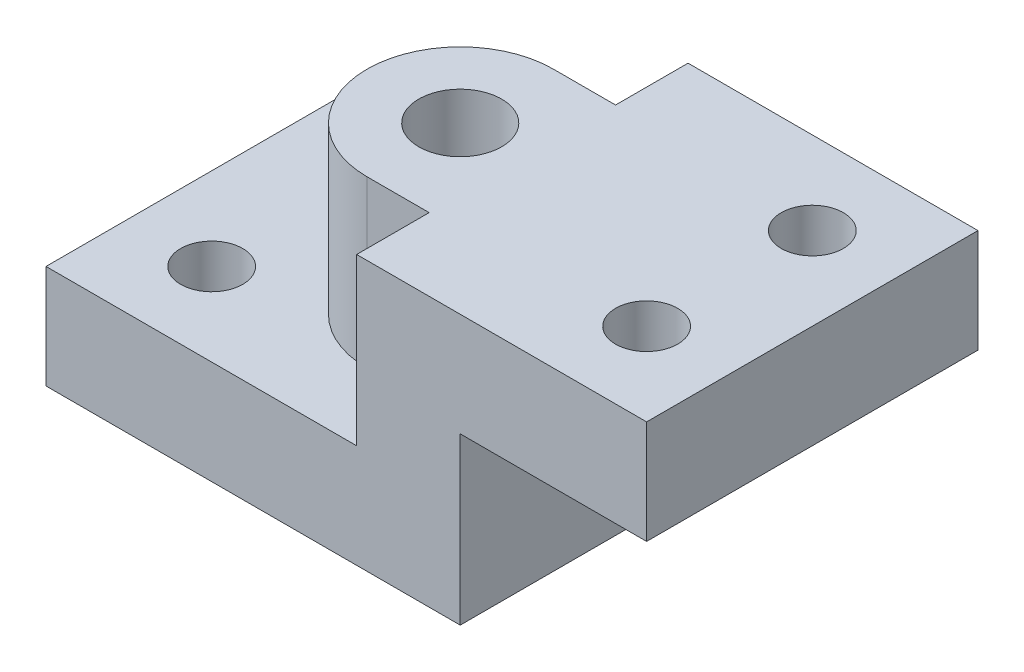
ISO-10303-21;
HEADER;
FILE_DESCRIPTION(('STEP AP214'),'2;1');
FILE_NAME('part.step','',(''),(''),'','','');
FILE_SCHEMA(('AUTOMOTIVE_DESIGN { 1 0 10303 214 1 1 1 1 }'));
ENDSEC;
DATA;
#1=APPLICATION_CONTEXT('core data for automotive mechanical design processes');
#2=APPLICATION_PROTOCOL_DEFINITION('international standard','automotive_design',2000,#1);
#3=PRODUCT_CONTEXT('',#1,'mechanical');
#4=PRODUCT('Part','Part','',(#3));
#5=PRODUCT_RELATED_PRODUCT_CATEGORY('part','',(#4));
#6=PRODUCT_DEFINITION_FORMATION('','',#4);
#7=PRODUCT_DEFINITION_CONTEXT('part definition',#1,'design');
#8=PRODUCT_DEFINITION('design','',#6,#7);
#9=PRODUCT_DEFINITION_SHAPE('','',#8);
#10=(LENGTH_UNIT() NAMED_UNIT(*) SI_UNIT(.MILLI.,.METRE.));
#11=(NAMED_UNIT(*) PLANE_ANGLE_UNIT() SI_UNIT($,.RADIAN.));
#12=(NAMED_UNIT(*) SI_UNIT($,.STERADIAN.) SOLID_ANGLE_UNIT());
#13=UNCERTAINTY_MEASURE_WITH_UNIT(LENGTH_MEASURE(1.E-05),#10,'distance_accuracy_value','');
#14=(GEOMETRIC_REPRESENTATION_CONTEXT(3) GLOBAL_UNCERTAINTY_ASSIGNED_CONTEXT((#13)) GLOBAL_UNIT_ASSIGNED_CONTEXT((#10,
#11,#12)) REPRESENTATION_CONTEXT('',''));
#15=CARTESIAN_POINT('',(0.,0.,0.));
#16=DIRECTION('',(0.,0.,1.));
#17=DIRECTION('',(1.,0.,0.));
#18=AXIS2_PLACEMENT_3D('',#15,#16,#17);
#19=CARTESIAN_POINT('',(39.649493318189,0.,80.));
#20=DIRECTION('',(-1.,0.,0.));
#21=DIRECTION('',(0.,0.,1.));
#22=AXIS2_PLACEMENT_3D('',#19,#20,#21);
#23=PLANE('',#22);
#24=DIRECTION('',(0.,0.,-1.));
#25=VECTOR('',#24,1.);
#26=CARTESIAN_POINT('',(39.649493318189,80.,80.));
#27=LINE('',#26,#25);
#28=CARTESIAN_POINT('',(39.649493318189,80.,80.));
#29=VERTEX_POINT('',#28);
#30=CARTESIAN_POINT('',(39.649493318189,80.,45.));
#31=VERTEX_POINT('',#30);
#32=EDGE_CURVE('E183',#29,#31,#27,.T.);
#33=ORIENTED_EDGE('',*,*,#32,.T.);
#34=DIRECTION('',(0.,-1.,0.));
#35=VECTOR('',#34,1.);
#36=CARTESIAN_POINT('',(39.649493318189,197.1537451386,45.));
#37=LINE('',#36,#35);
#38=CARTESIAN_POINT('',(39.649493318189,0.,45.));
#39=VERTEX_POINT('',#38);
#40=EDGE_CURVE('E248',#31,#39,#37,.T.);
#41=ORIENTED_EDGE('',*,*,#40,.T.);
#42=DIRECTION('',(0.,0.,-1.));
#43=VECTOR('',#42,1.);
#44=CARTESIAN_POINT('',(39.649493318189,0.,80.));
#45=LINE('',#44,#43);
#46=CARTESIAN_POINT('',(39.649493318189,0.,80.));
#47=VERTEX_POINT('',#46);
#48=EDGE_CURVE('E186',#47,#39,#45,.T.);
#49=ORIENTED_EDGE('',*,*,#48,.F.);
#50=DIRECTION('',(0.,1.,0.));
#51=VECTOR('',#50,1.);
#52=CARTESIAN_POINT('',(39.649493318189,0.,80.));
#53=LINE('',#52,#51);
#54=EDGE_CURVE('E267',#47,#29,#53,.T.);
#55=ORIENTED_EDGE('',*,*,#54,.T.);
#56=EDGE_LOOP('',(#33,#41,#49,#55));
#57=FACE_BOUND('',#56,.T.);
#58=ADVANCED_FACE('F46',(#57),#23,.T.);
#59=CARTESIAN_POINT('',(39.649493318189,0.,-45.));
#60=VERTEX_POINT('',#59);
#61=CARTESIAN_POINT('',(39.649493318189,0.,-80.));
#62=VERTEX_POINT('',#61);
#63=EDGE_CURVE('E188',#60,#62,#45,.T.);
#64=ORIENTED_EDGE('',*,*,#63,.F.);
#65=DIRECTION('',(0.,-1.,0.));
#66=VECTOR('',#65,1.);
#67=CARTESIAN_POINT('',(39.649493318189,197.1537451386,-45.));
#68=LINE('',#67,#66);
#69=CARTESIAN_POINT('',(39.649493318189,80.,-45.));
#70=VERTEX_POINT('',#69);
#71=EDGE_CURVE('E63',#70,#60,#68,.T.);
#72=ORIENTED_EDGE('',*,*,#71,.F.);
#73=CARTESIAN_POINT('',(39.649493318189,80.,-80.));
#74=VERTEX_POINT('',#73);
#75=EDGE_CURVE('E185',#70,#74,#27,.T.);
#76=ORIENTED_EDGE('',*,*,#75,.T.);
#77=DIRECTION('',(0.,1.,0.));
#78=VECTOR('',#77,1.);
#79=CARTESIAN_POINT('',(39.649493318189,0.,-80.));
#80=LINE('',#79,#78);
#81=EDGE_CURVE('E163',#62,#74,#80,.T.);
#82=ORIENTED_EDGE('',*,*,#81,.F.);
#83=EDGE_LOOP('',(#64,#72,#76,#82));
#84=FACE_BOUND('',#83,.T.);
#85=ADVANCED_FACE('F209',(#84),#23,.T.);
#86=CARTESIAN_POINT('',(-110.350506681811,0.,80.));
#87=DIRECTION('',(0.,1.,0.));
#88=DIRECTION('',(0.,0.,1.));
#89=AXIS2_PLACEMENT_3D('',#86,#87,#88);
#90=PLANE('',#89);
#91=CARTESIAN_POINT('',(-70.3505066818109,0.,40.));
#92=DIRECTION('',(0.,1.,0.));
#93=DIRECTION('',(0.,0.,1.));
#94=AXIS2_PLACEMENT_3D('',#91,#92,#93);
#95=CIRCLE('',#94,15.);
#96=CARTESIAN_POINT('',(-70.3505066818109,0.,55.));
#97=VERTEX_POINT('',#96);
#98=EDGE_CURVE('E226',#97,#97,#95,.T.);
#99=ORIENTED_EDGE('',*,*,#98,.F.);
#100=EDGE_LOOP('',(#99));
#101=FACE_BOUND('',#100,.T.);
#102=CARTESIAN_POINT('',(-70.3505066818109,0.,-40.));
#103=DIRECTION('',(0.,1.,0.));
#104=DIRECTION('',(0.,0.,1.));
#105=AXIS2_PLACEMENT_3D('',#102,#103,#104);
#106=CIRCLE('',#105,15.);
#107=CARTESIAN_POINT('',(-70.3505066818109,0.,-25.));
#108=VERTEX_POINT('',#107);
#109=EDGE_CURVE('E229',#108,#108,#106,.T.);
#110=ORIENTED_EDGE('',*,*,#109,.F.);
#111=EDGE_LOOP('',(#110));
#112=FACE_BOUND('',#111,.T.);
#113=ORIENTED_EDGE('',*,*,#48,.T.);
#114=DIRECTION('',(1.,0.,0.));
#115=VECTOR('',#114,1.);
#116=CARTESIAN_POINT('',(9.64949331818904,0.,45.));
#117=LINE('',#116,#115);
#118=CARTESIAN_POINT('',(9.64949331818904,0.,45.));
#119=VERTEX_POINT('',#118);
#120=EDGE_CURVE('E245',#119,#39,#117,.T.);
#121=ORIENTED_EDGE('',*,*,#120,.F.);
#122=CARTESIAN_POINT('',(9.64949331818904,0.,0.));
#123=DIRECTION('',(0.,1.,0.));
#124=DIRECTION('',(0.,0.,1.));
#125=AXIS2_PLACEMENT_3D('',#122,#123,#124);
#126=CIRCLE('',#125,45.);
#127=CARTESIAN_POINT('',(9.64949331818904,0.,-45.));
#128=VERTEX_POINT('',#127);
#129=EDGE_CURVE('E235',#128,#119,#126,.T.);
#130=ORIENTED_EDGE('',*,*,#129,.F.);
#131=DIRECTION('',(-1.,0.,0.));
#132=VECTOR('',#131,1.);
#133=CARTESIAN_POINT('',(9.64949331818904,0.,-45.));
#134=LINE('',#133,#132);
#135=EDGE_CURVE('E242',#60,#128,#134,.T.);
#136=ORIENTED_EDGE('',*,*,#135,.F.);
#137=ORIENTED_EDGE('',*,*,#63,.T.);
#138=DIRECTION('',(1.,0.,0.));
#139=VECTOR('',#138,1.);
#140=CARTESIAN_POINT('',(-110.350506681811,0.,-80.));
#141=LINE('',#140,#139);
#142=CARTESIAN_POINT('',(-110.350506681811,0.,-80.));
#143=VERTEX_POINT('',#142);
#144=EDGE_CURVE('E159',#143,#62,#141,.T.);
#145=ORIENTED_EDGE('',*,*,#144,.F.);
#146=DIRECTION('',(0.,0.,-1.));
#147=VECTOR('',#146,1.);
#148=CARTESIAN_POINT('',(-110.350506681811,0.,80.));
#149=LINE('',#148,#147);
#150=CARTESIAN_POINT('',(-110.350506681811,0.,80.));
#151=VERTEX_POINT('',#150);
#152=EDGE_CURVE('E50',#151,#143,#149,.T.);
#153=ORIENTED_EDGE('',*,*,#152,.F.);
#154=DIRECTION('',(1.,0.,0.));
#155=VECTOR('',#154,1.);
#156=CARTESIAN_POINT('',(-110.350506681811,0.,80.));
#157=LINE('',#156,#155);
#158=EDGE_CURVE('E265',#151,#47,#157,.T.);
#159=ORIENTED_EDGE('',*,*,#158,.T.);
#160=EDGE_LOOP('',(#113,#121,#130,#136,#137,#145,#153,#159));
#161=FACE_BOUND('',#160,.T.);
#162=ADVANCED_FACE('F193',(#101,#112,#161),#90,.T.);
#163=CARTESIAN_POINT('',(-110.350506681811,-50.,80.));
#164=DIRECTION('',(-1.,0.,0.));
#165=DIRECTION('',(0.,0.,1.));
#166=AXIS2_PLACEMENT_3D('',#163,#164,#165);
#167=PLANE('',#166);
#168=DIRECTION('',(0.,1.,0.));
#169=VECTOR('',#168,1.);
#170=CARTESIAN_POINT('',(-110.350506681811,-50.,-80.));
#171=LINE('',#170,#169);
#172=CARTESIAN_POINT('',(-110.350506681811,-50.,-80.));
#173=VERTEX_POINT('',#172);
#174=EDGE_CURVE('E156',#173,#143,#171,.T.);
#175=ORIENTED_EDGE('',*,*,#174,.F.);
#176=DIRECTION('',(0.,0.,-1.));
#177=VECTOR('',#176,1.);
#178=CARTESIAN_POINT('',(-110.350506681811,-50.,80.));
#179=LINE('',#178,#177);
#180=CARTESIAN_POINT('',(-110.350506681811,-50.,80.));
#181=VERTEX_POINT('',#180);
#182=EDGE_CURVE('E13',#181,#173,#179,.T.);
#183=ORIENTED_EDGE('',*,*,#182,.F.);
#184=DIRECTION('',(0.,1.,0.));
#185=VECTOR('',#184,1.);
#186=CARTESIAN_POINT('',(-110.350506681811,-50.,80.));
#187=LINE('',#186,#185);
#188=EDGE_CURVE('E177',#181,#151,#187,.T.);
#189=ORIENTED_EDGE('',*,*,#188,.T.);
#190=ORIENTED_EDGE('',*,*,#152,.T.);
#191=EDGE_LOOP('',(#175,#183,#189,#190));
#192=FACE_BOUND('',#191,.T.);
#193=ADVANCED_FACE('F48',(#192),#167,.T.);
#194=CARTESIAN_POINT('',(89.649493318189,-50.,80.));
#195=DIRECTION('',(0.,-1.,0.));
#196=DIRECTION('',(1.,0.,0.));
#197=AXIS2_PLACEMENT_3D('',#194,#195,#196);
#198=PLANE('',#197);
#199=CARTESIAN_POINT('',(9.64949331818904,-50.,0.));
#200=DIRECTION('',(0.,1.,0.));
#201=DIRECTION('',(0.,0.,1.));
#202=AXIS2_PLACEMENT_3D('',#199,#200,#201);
#203=CIRCLE('',#202,20.);
#204=CARTESIAN_POINT('',(9.64949331818904,-50.,20.));
#205=VERTEX_POINT('',#204);
#206=EDGE_CURVE('E327',#205,#205,#203,.T.);
#207=ORIENTED_EDGE('',*,*,#206,.T.);
#208=EDGE_LOOP('',(#207));
#209=FACE_BOUND('',#208,.T.);
#210=CARTESIAN_POINT('',(-70.3505066818109,-50.,40.));
#211=DIRECTION('',(0.,1.,0.));
#212=DIRECTION('',(0.,0.,1.));
#213=AXIS2_PLACEMENT_3D('',#210,#211,#212);
#214=CIRCLE('',#213,15.);
#215=CARTESIAN_POINT('',(-70.3505066818109,-50.,55.));
#216=VERTEX_POINT('',#215);
#217=EDGE_CURVE('E324',#216,#216,#214,.T.);
#218=ORIENTED_EDGE('',*,*,#217,.T.);
#219=EDGE_LOOP('',(#218));
#220=FACE_BOUND('',#219,.T.);
#221=CARTESIAN_POINT('',(-70.3505066818109,-50.,-40.));
#222=DIRECTION('',(0.,1.,0.));
#223=DIRECTION('',(0.,0.,1.));
#224=AXIS2_PLACEMENT_3D('',#221,#222,#223);
#225=CIRCLE('',#224,15.);
#226=CARTESIAN_POINT('',(-70.3505066818109,-50.,-25.));
#227=VERTEX_POINT('',#226);
#228=EDGE_CURVE('E232',#227,#227,#225,.T.);
#229=ORIENTED_EDGE('',*,*,#228,.T.);
#230=EDGE_LOOP('',(#229));
#231=FACE_BOUND('',#230,.T.);
#232=DIRECTION('',(-1.,0.,0.));
#233=VECTOR('',#232,1.);
#234=CARTESIAN_POINT('',(89.649493318189,-50.,-80.));
#235=LINE('',#234,#233);
#236=CARTESIAN_POINT('',(89.649493318189,-50.,-80.));
#237=VERTEX_POINT('',#236);
#238=EDGE_CURVE('E175',#237,#173,#235,.T.);
#239=ORIENTED_EDGE('',*,*,#238,.F.);
#240=DIRECTION('',(0.,0.,-1.));
#241=VECTOR('',#240,1.);
#242=CARTESIAN_POINT('',(89.649493318189,-50.,80.));
#243=LINE('',#242,#241);
#244=CARTESIAN_POINT('',(89.649493318189,-50.,80.));
#245=VERTEX_POINT('',#244);
#246=EDGE_CURVE('E55',#245,#237,#243,.T.);
#247=ORIENTED_EDGE('',*,*,#246,.F.);
#248=DIRECTION('',(-1.,0.,0.));
#249=VECTOR('',#248,1.);
#250=CARTESIAN_POINT('',(89.649493318189,-50.,80.));
#251=LINE('',#250,#249);
#252=EDGE_CURVE('E146',#245,#181,#251,.T.);
#253=ORIENTED_EDGE('',*,*,#252,.T.);
#254=ORIENTED_EDGE('',*,*,#182,.T.);
#255=EDGE_LOOP('',(#239,#247,#253,#254));
#256=FACE_BOUND('',#255,.T.);
#257=ADVANCED_FACE('F196',(#209,#220,#231,#256),#198,.T.);
#258=CARTESIAN_POINT('',(89.649493318189,30.,80.));
#259=DIRECTION('',(1.,0.,0.));
#260=DIRECTION('',(0.,0.,-1.));
#261=AXIS2_PLACEMENT_3D('',#258,#259,#260);
#262=PLANE('',#261);
#263=DIRECTION('',(0.,-1.,0.));
#264=VECTOR('',#263,1.);
#265=CARTESIAN_POINT('',(89.649493318189,30.,-80.));
#266=LINE('',#265,#264);
#267=CARTESIAN_POINT('',(89.649493318189,30.,-80.));
#268=VERTEX_POINT('',#267);
#269=EDGE_CURVE('E133',#268,#237,#266,.T.);
#270=ORIENTED_EDGE('',*,*,#269,.F.);
#271=DIRECTION('',(0.,0.,-1.));
#272=VECTOR('',#271,1.);
#273=CARTESIAN_POINT('',(89.649493318189,30.,80.));
#274=LINE('',#273,#272);
#275=CARTESIAN_POINT('',(89.649493318189,30.,80.));
#276=VERTEX_POINT('',#275);
#277=EDGE_CURVE('E127',#276,#268,#274,.T.);
#278=ORIENTED_EDGE('',*,*,#277,.F.);
#279=DIRECTION('',(0.,-1.,0.));
#280=VECTOR('',#279,1.);
#281=CARTESIAN_POINT('',(89.649493318189,30.,80.));
#282=LINE('',#281,#280);
#283=EDGE_CURVE('E130',#276,#245,#282,.T.);
#284=ORIENTED_EDGE('',*,*,#283,.T.);
#285=ORIENTED_EDGE('',*,*,#246,.T.);
#286=EDGE_LOOP('',(#270,#278,#284,#285));
#287=FACE_BOUND('',#286,.T.);
#288=ADVANCED_FACE('F129',(#287),#262,.T.);
#289=CARTESIAN_POINT('',(179.649493318189,30.,80.));
#290=DIRECTION('',(0.,-1.,0.));
#291=DIRECTION('',(1.,0.,0.));
#292=AXIS2_PLACEMENT_3D('',#289,#290,#291);
#293=PLANE('',#292);
#294=CARTESIAN_POINT('',(139.649493318189,30.,40.));
#295=DIRECTION('',(0.,-1.,0.));
#296=DIRECTION('',(1.,0.,0.));
#297=AXIS2_PLACEMENT_3D('',#294,#295,#296);
#298=CIRCLE('',#297,15.);
#299=CARTESIAN_POINT('',(154.649493318189,30.,40.));
#300=VERTEX_POINT('',#299);
#301=EDGE_CURVE('E311',#300,#300,#298,.T.);
#302=ORIENTED_EDGE('',*,*,#301,.F.);
#303=EDGE_LOOP('',(#302));
#304=FACE_BOUND('',#303,.T.);
#305=CARTESIAN_POINT('',(139.649493318189,30.,-40.));
#306=DIRECTION('',(0.,-1.,0.));
#307=DIRECTION('',(1.,0.,0.));
#308=AXIS2_PLACEMENT_3D('',#305,#306,#307);
#309=CIRCLE('',#308,15.);
#310=CARTESIAN_POINT('',(154.649493318189,30.,-40.));
#311=VERTEX_POINT('',#310);
#312=EDGE_CURVE('E238',#311,#311,#309,.T.);
#313=ORIENTED_EDGE('',*,*,#312,.F.);
#314=EDGE_LOOP('',(#313));
#315=FACE_BOUND('',#314,.T.);
#316=DIRECTION('',(-1.,0.,0.));
#317=VECTOR('',#316,1.);
#318=CARTESIAN_POINT('',(179.649493318189,30.,-80.));
#319=LINE('',#318,#317);
#320=CARTESIAN_POINT('',(179.649493318189,30.,-80.));
#321=VERTEX_POINT('',#320);
#322=EDGE_CURVE('E172',#321,#268,#319,.T.);
#323=ORIENTED_EDGE('',*,*,#322,.F.);
#324=DIRECTION('',(0.,0.,-1.));
#325=VECTOR('',#324,1.);
#326=CARTESIAN_POINT('',(179.649493318189,30.,80.));
#327=LINE('',#326,#325);
#328=CARTESIAN_POINT('',(179.649493318189,30.,80.));
#329=VERTEX_POINT('',#328);
#330=EDGE_CURVE('E138',#329,#321,#327,.T.);
#331=ORIENTED_EDGE('',*,*,#330,.F.);
#332=DIRECTION('',(-1.,0.,0.));
#333=VECTOR('',#332,1.);
#334=CARTESIAN_POINT('',(179.649493318189,30.,80.));
#335=LINE('',#334,#333);
#336=EDGE_CURVE('E144',#329,#276,#335,.T.);
#337=ORIENTED_EDGE('',*,*,#336,.T.);
#338=ORIENTED_EDGE('',*,*,#277,.T.);
#339=EDGE_LOOP('',(#323,#331,#337,#338));
#340=FACE_BOUND('',#339,.T.);
#341=ADVANCED_FACE('F148',(#304,#315,#340),#293,.T.);
#342=CARTESIAN_POINT('',(179.649493318189,80.,80.));
#343=DIRECTION('',(1.,0.,0.));
#344=DIRECTION('',(0.,0.,-1.));
#345=AXIS2_PLACEMENT_3D('',#342,#343,#344);
#346=PLANE('',#345);
#347=DIRECTION('',(0.,-1.,0.));
#348=VECTOR('',#347,1.);
#349=CARTESIAN_POINT('',(179.649493318189,80.,-80.));
#350=LINE('',#349,#348);
#351=CARTESIAN_POINT('',(179.649493318189,80.,-80.));
#352=VERTEX_POINT('',#351);
#353=EDGE_CURVE('E169',#352,#321,#350,.T.);
#354=ORIENTED_EDGE('',*,*,#353,.F.);
#355=DIRECTION('',(0.,0.,-1.));
#356=VECTOR('',#355,1.);
#357=CARTESIAN_POINT('',(179.649493318189,80.,80.));
#358=LINE('',#357,#356);
#359=CARTESIAN_POINT('',(179.649493318189,80.,80.));
#360=VERTEX_POINT('',#359);
#361=EDGE_CURVE('E181',#360,#352,#358,.T.);
#362=ORIENTED_EDGE('',*,*,#361,.F.);
#363=DIRECTION('',(0.,-1.,0.));
#364=VECTOR('',#363,1.);
#365=CARTESIAN_POINT('',(179.649493318189,80.,80.));
#366=LINE('',#365,#364);
#367=EDGE_CURVE('E149',#360,#329,#366,.T.);
#368=ORIENTED_EDGE('',*,*,#367,.T.);
#369=ORIENTED_EDGE('',*,*,#330,.T.);
#370=EDGE_LOOP('',(#354,#362,#368,#369));
#371=FACE_BOUND('',#370,.T.);
#372=ADVANCED_FACE('F297',(#371),#346,.T.);
#373=CARTESIAN_POINT('',(39.649493318189,80.,80.));
#374=DIRECTION('',(0.,1.,0.));
#375=DIRECTION('',(0.,0.,1.));
#376=AXIS2_PLACEMENT_3D('',#373,#374,#375);
#377=PLANE('',#376);
#378=CARTESIAN_POINT('',(9.64949331818904,80.,0.));
#379=DIRECTION('',(0.,1.,0.));
#380=DIRECTION('',(0.,0.,1.));
#381=AXIS2_PLACEMENT_3D('',#378,#379,#380);
#382=CIRCLE('',#381,20.);
#383=CARTESIAN_POINT('',(9.64949331818904,80.,20.));
#384=VERTEX_POINT('',#383);
#385=EDGE_CURVE('E328',#384,#384,#382,.T.);
#386=ORIENTED_EDGE('',*,*,#385,.F.);
#387=EDGE_LOOP('',(#386));
#388=FACE_BOUND('',#387,.T.);
#389=CARTESIAN_POINT('',(139.649493318189,80.,40.));
#390=DIRECTION('',(0.,1.,0.));
#391=DIRECTION('',(0.,0.,1.));
#392=AXIS2_PLACEMENT_3D('',#389,#390,#391);
#393=CIRCLE('',#392,15.);
#394=CARTESIAN_POINT('',(139.649493318189,80.,55.));
#395=VERTEX_POINT('',#394);
#396=EDGE_CURVE('E320',#395,#395,#393,.T.);
#397=ORIENTED_EDGE('',*,*,#396,.F.);
#398=EDGE_LOOP('',(#397));
#399=FACE_BOUND('',#398,.T.);
#400=CARTESIAN_POINT('',(139.649493318189,80.,-40.));
#401=DIRECTION('',(0.,1.,0.));
#402=DIRECTION('',(0.,0.,1.));
#403=AXIS2_PLACEMENT_3D('',#400,#401,#402);
#404=CIRCLE('',#403,15.);
#405=CARTESIAN_POINT('',(139.649493318189,80.,-25.));
#406=VERTEX_POINT('',#405);
#407=EDGE_CURVE('E315',#406,#406,#404,.T.);
#408=ORIENTED_EDGE('',*,*,#407,.F.);
#409=EDGE_LOOP('',(#408));
#410=FACE_BOUND('',#409,.T.);
#411=DIRECTION('',(1.,0.,0.));
#412=VECTOR('',#411,1.);
#413=CARTESIAN_POINT('',(39.649493318189,80.,-80.));
#414=LINE('',#413,#412);
#415=EDGE_CURVE('E166',#74,#352,#414,.T.);
#416=ORIENTED_EDGE('',*,*,#415,.F.);
#417=ORIENTED_EDGE('',*,*,#75,.F.);
#418=DIRECTION('',(-1.,0.,0.));
#419=VECTOR('',#418,1.);
#420=CARTESIAN_POINT('',(9.64949331818904,80.,-45.));
#421=LINE('',#420,#419);
#422=CARTESIAN_POINT('',(9.64949331818904,80.,-45.));
#423=VERTEX_POINT('',#422);
#424=EDGE_CURVE('E244',#70,#423,#421,.T.);
#425=ORIENTED_EDGE('',*,*,#424,.T.);
#426=CARTESIAN_POINT('',(9.64949331818904,80.,0.));
#427=DIRECTION('',(0.,1.,0.));
#428=DIRECTION('',(0.,0.,1.));
#429=AXIS2_PLACEMENT_3D('',#426,#427,#428);
#430=CIRCLE('',#429,45.);
#431=CARTESIAN_POINT('',(9.64949331818904,80.,45.));
#432=VERTEX_POINT('',#431);
#433=EDGE_CURVE('E254',#423,#432,#430,.T.);
#434=ORIENTED_EDGE('',*,*,#433,.T.);
#435=DIRECTION('',(1.,0.,0.));
#436=VECTOR('',#435,1.);
#437=CARTESIAN_POINT('',(9.64949331818904,80.,45.));
#438=LINE('',#437,#436);
#439=EDGE_CURVE('E160',#432,#31,#438,.T.);
#440=ORIENTED_EDGE('',*,*,#439,.T.);
#441=ORIENTED_EDGE('',*,*,#32,.F.);
#442=DIRECTION('',(1.,0.,0.));
#443=VECTOR('',#442,1.);
#444=CARTESIAN_POINT('',(39.649493318189,80.,80.));
#445=LINE('',#444,#443);
#446=EDGE_CURVE('E151',#29,#360,#445,.T.);
#447=ORIENTED_EDGE('',*,*,#446,.T.);
#448=ORIENTED_EDGE('',*,*,#361,.T.);
#449=EDGE_LOOP('',(#416,#417,#425,#434,#440,#441,#447,#448));
#450=FACE_BOUND('',#449,.T.);
#451=ADVANCED_FACE('F217',(#388,#399,#410,#450),#377,.T.);
#452=CARTESIAN_POINT('',(0.,0.,80.));
#453=DIRECTION('',(0.,0.,-1.));
#454=DIRECTION('',(-1.,0.,0.));
#455=AXIS2_PLACEMENT_3D('',#452,#453,#454);
#456=PLANE('',#455);
#457=ORIENTED_EDGE('',*,*,#188,.F.);
#458=ORIENTED_EDGE('',*,*,#252,.F.);
#459=ORIENTED_EDGE('',*,*,#283,.F.);
#460=ORIENTED_EDGE('',*,*,#336,.F.);
#461=ORIENTED_EDGE('',*,*,#367,.F.);
#462=ORIENTED_EDGE('',*,*,#446,.F.);
#463=ORIENTED_EDGE('',*,*,#54,.F.);
#464=ORIENTED_EDGE('',*,*,#158,.F.);
#465=EDGE_LOOP('',(#457,#458,#459,#460,#461,#462,#463,#464));
#466=FACE_BOUND('',#465,.T.);
#467=ADVANCED_FACE('F142',(#466),#456,.F.);
#468=CARTESIAN_POINT('',(0.,0.,-80.));
#469=DIRECTION('',(0.,0.,-1.));
#470=DIRECTION('',(-1.,0.,0.));
#471=AXIS2_PLACEMENT_3D('',#468,#469,#470);
#472=PLANE('',#471);
#473=ORIENTED_EDGE('',*,*,#174,.T.);
#474=ORIENTED_EDGE('',*,*,#144,.T.);
#475=ORIENTED_EDGE('',*,*,#81,.T.);
#476=ORIENTED_EDGE('',*,*,#415,.T.);
#477=ORIENTED_EDGE('',*,*,#353,.T.);
#478=ORIENTED_EDGE('',*,*,#322,.T.);
#479=ORIENTED_EDGE('',*,*,#269,.T.);
#480=ORIENTED_EDGE('',*,*,#238,.T.);
#481=EDGE_LOOP('',(#473,#474,#475,#476,#477,#478,#479,#480));
#482=FACE_BOUND('',#481,.T.);
#483=ADVANCED_FACE('F195',(#482),#472,.T.);
#484=CARTESIAN_POINT('',(9.64949331818904,197.1537451386,0.));
#485=DIRECTION('',(0.,-1.,0.));
#486=DIRECTION('',(0.,0.,-1.));
#487=AXIS2_PLACEMENT_3D('',#484,#485,#486);
#488=CYLINDRICAL_SURFACE('',#487,45.);
#489=ORIENTED_EDGE('',*,*,#433,.F.);
#490=DIRECTION('',(0.,-1.,0.));
#491=VECTOR('',#490,1.);
#492=CARTESIAN_POINT('',(9.64949331818904,197.1537451386,-45.));
#493=LINE('',#492,#491);
#494=EDGE_CURVE('E231',#423,#128,#493,.T.);
#495=ORIENTED_EDGE('',*,*,#494,.T.);
#496=ORIENTED_EDGE('',*,*,#129,.T.);
#497=DIRECTION('',(0.,-1.,0.));
#498=VECTOR('',#497,1.);
#499=CARTESIAN_POINT('',(9.64949331818904,197.1537451386,45.));
#500=LINE('',#499,#498);
#501=EDGE_CURVE('E249',#432,#119,#500,.T.);
#502=ORIENTED_EDGE('',*,*,#501,.F.);
#503=EDGE_LOOP('',(#489,#495,#496,#502));
#504=FACE_BOUND('',#503,.T.);
#505=ADVANCED_FACE('F291',(#504),#488,.T.);
#506=CARTESIAN_POINT('',(9.64949331818904,197.1537451386,45.));
#507=DIRECTION('',(0.,0.,-1.));
#508=DIRECTION('',(-1.,0.,0.));
#509=AXIS2_PLACEMENT_3D('',#506,#507,#508);
#510=PLANE('',#509);
#511=ORIENTED_EDGE('',*,*,#439,.F.);
#512=ORIENTED_EDGE('',*,*,#501,.T.);
#513=ORIENTED_EDGE('',*,*,#120,.T.);
#514=ORIENTED_EDGE('',*,*,#40,.F.);
#515=EDGE_LOOP('',(#511,#512,#513,#514));
#516=FACE_BOUND('',#515,.T.);
#517=ADVANCED_FACE('F281',(#516),#510,.F.);
#518=CARTESIAN_POINT('',(9.64949331818904,197.1537451386,-45.));
#519=DIRECTION('',(0.,0.,1.));
#520=DIRECTION('',(1.,0.,0.));
#521=AXIS2_PLACEMENT_3D('',#518,#519,#520);
#522=PLANE('',#521);
#523=ORIENTED_EDGE('',*,*,#424,.F.);
#524=ORIENTED_EDGE('',*,*,#71,.T.);
#525=ORIENTED_EDGE('',*,*,#135,.T.);
#526=ORIENTED_EDGE('',*,*,#494,.F.);
#527=EDGE_LOOP('',(#523,#524,#525,#526));
#528=FACE_BOUND('',#527,.T.);
#529=ADVANCED_FACE('F355',(#528),#522,.F.);
#530=CARTESIAN_POINT('',(-70.3505066818109,-50.,-40.));
#531=DIRECTION('',(0.,1.,0.));
#532=DIRECTION('',(0.,0.,1.));
#533=AXIS2_PLACEMENT_3D('',#530,#531,#532);
#534=CYLINDRICAL_SURFACE('',#533,15.);
#535=ORIENTED_EDGE('',*,*,#109,.T.);
#536=EDGE_LOOP('',(#535));
#537=FACE_BOUND('',#536,.T.);
#538=ORIENTED_EDGE('',*,*,#228,.F.);
#539=EDGE_LOOP('',(#538));
#540=FACE_BOUND('',#539,.T.);
#541=ADVANCED_FACE('F347',(#537,#540),#534,.F.);
#542=CARTESIAN_POINT('',(139.649493318189,-50.,-40.));
#543=DIRECTION('',(0.,1.,0.));
#544=DIRECTION('',(0.,0.,1.));
#545=AXIS2_PLACEMENT_3D('',#542,#543,#544);
#546=CYLINDRICAL_SURFACE('',#545,15.);
#547=ORIENTED_EDGE('',*,*,#312,.T.);
#548=EDGE_LOOP('',(#547));
#549=FACE_BOUND('',#548,.T.);
#550=ORIENTED_EDGE('',*,*,#407,.T.);
#551=EDGE_LOOP('',(#550));
#552=FACE_BOUND('',#551,.T.);
#553=ADVANCED_FACE('F344',(#549,#552),#546,.F.);
#554=CARTESIAN_POINT('',(139.649493318189,-50.,40.));
#555=DIRECTION('',(0.,1.,0.));
#556=DIRECTION('',(0.,0.,1.));
#557=AXIS2_PLACEMENT_3D('',#554,#555,#556);
#558=CYLINDRICAL_SURFACE('',#557,15.);
#559=ORIENTED_EDGE('',*,*,#301,.T.);
#560=EDGE_LOOP('',(#559));
#561=FACE_BOUND('',#560,.T.);
#562=ORIENTED_EDGE('',*,*,#396,.T.);
#563=EDGE_LOOP('',(#562));
#564=FACE_BOUND('',#563,.T.);
#565=ADVANCED_FACE('F346',(#561,#564),#558,.F.);
#566=CARTESIAN_POINT('',(-70.3505066818109,-50.,40.));
#567=DIRECTION('',(0.,1.,0.));
#568=DIRECTION('',(0.,0.,1.));
#569=AXIS2_PLACEMENT_3D('',#566,#567,#568);
#570=CYLINDRICAL_SURFACE('',#569,15.);
#571=ORIENTED_EDGE('',*,*,#98,.T.);
#572=EDGE_LOOP('',(#571));
#573=FACE_BOUND('',#572,.T.);
#574=ORIENTED_EDGE('',*,*,#217,.F.);
#575=EDGE_LOOP('',(#574));
#576=FACE_BOUND('',#575,.T.);
#577=ADVANCED_FACE('F336',(#573,#576),#570,.F.);
#578=CARTESIAN_POINT('',(9.64949331818904,-50.,0.));
#579=DIRECTION('',(0.,1.,0.));
#580=DIRECTION('',(0.,0.,1.));
#581=AXIS2_PLACEMENT_3D('',#578,#579,#580);
#582=CYLINDRICAL_SURFACE('',#581,20.);
#583=ORIENTED_EDGE('',*,*,#206,.F.);
#584=EDGE_LOOP('',(#583));
#585=FACE_BOUND('',#584,.T.);
#586=ORIENTED_EDGE('',*,*,#385,.T.);
#587=EDGE_LOOP('',(#586));
#588=FACE_BOUND('',#587,.T.);
#589=ADVANCED_FACE('F333',(#585,#588),#582,.F.);
#590=CLOSED_SHELL('',(#58,#85,#162,#193,#257,#288,#341,#372,#451,#467,#483,#505,#517,#529,#541,
#553,#565,#577,#589));
#591=MANIFOLD_SOLID_BREP('B2',#590);
#592=ADVANCED_BREP_SHAPE_REPRESENTATION('',(#18,#591),#14);
#593=SHAPE_DEFINITION_REPRESENTATION(#9,#592);
ENDSEC;
END-ISO-10303-21;
